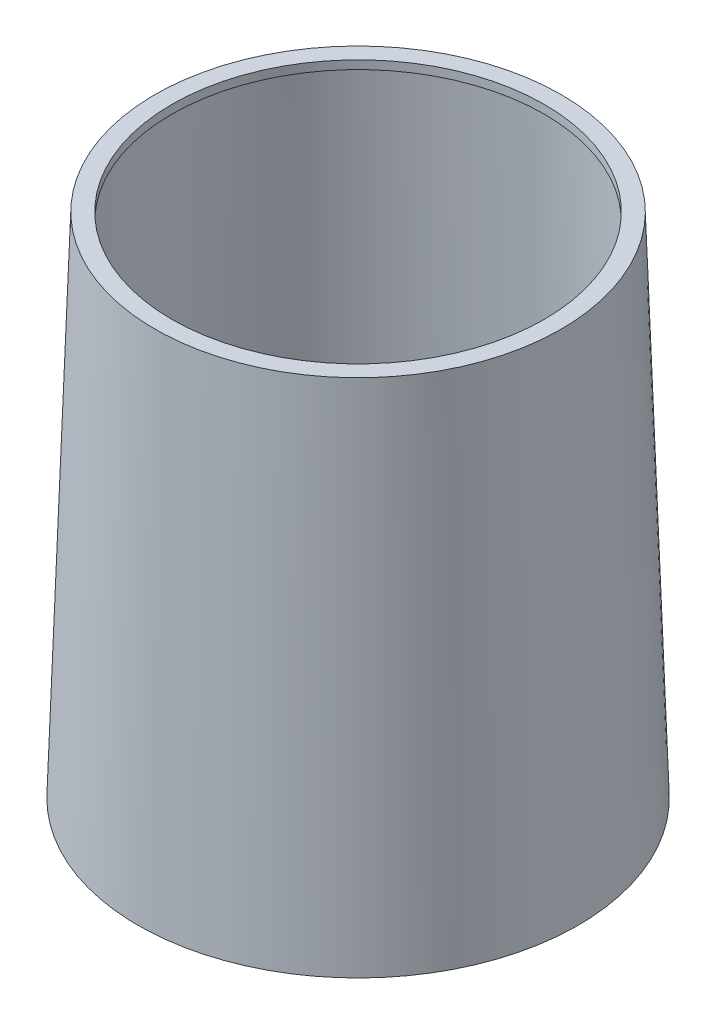
ISO-10303-21;
HEADER;
FILE_DESCRIPTION(('STEP AP214'),'2;1');
FILE_NAME('part.step','',(''),(''),'','','');
FILE_SCHEMA(('AUTOMOTIVE_DESIGN { 1 0 10303 214 1 1 1 1 }'));
ENDSEC;
DATA;
#1=APPLICATION_CONTEXT('core data for automotive mechanical design processes');
#2=APPLICATION_PROTOCOL_DEFINITION('international standard','automotive_design',2000,#1);
#3=PRODUCT_CONTEXT('',#1,'mechanical');
#4=PRODUCT('Part','Part','',(#3));
#5=PRODUCT_RELATED_PRODUCT_CATEGORY('part','',(#4));
#6=PRODUCT_DEFINITION_FORMATION('','',#4);
#7=PRODUCT_DEFINITION_CONTEXT('part definition',#1,'design');
#8=PRODUCT_DEFINITION('design','',#6,#7);
#9=PRODUCT_DEFINITION_SHAPE('','',#8);
#10=(LENGTH_UNIT() NAMED_UNIT(*) SI_UNIT(.MILLI.,.METRE.));
#11=(NAMED_UNIT(*) PLANE_ANGLE_UNIT() SI_UNIT($,.RADIAN.));
#12=(NAMED_UNIT(*) SI_UNIT($,.STERADIAN.) SOLID_ANGLE_UNIT());
#13=UNCERTAINTY_MEASURE_WITH_UNIT(LENGTH_MEASURE(1.E-05),#10,'distance_accuracy_value','');
#14=(GEOMETRIC_REPRESENTATION_CONTEXT(3) GLOBAL_UNCERTAINTY_ASSIGNED_CONTEXT((#13)) GLOBAL_UNIT_ASSIGNED_CONTEXT((#10,
#11,#12)) REPRESENTATION_CONTEXT('',''));
#15=CARTESIAN_POINT('',(0.,0.,0.));
#16=DIRECTION('',(0.,0.,1.));
#17=DIRECTION('',(1.,0.,0.));
#18=AXIS2_PLACEMENT_3D('',#15,#16,#17);
#19=CARTESIAN_POINT('',(0.,30.,0.));
#20=DIRECTION('',(0.,1.,0.));
#21=DIRECTION('',(0.,0.,1.));
#22=AXIS2_PLACEMENT_3D('',#19,#20,#21);
#23=PLANE('',#22);
#24=CARTESIAN_POINT('',(0.,30.,0.));
#25=DIRECTION('',(0.,1.,0.));
#26=DIRECTION('',(0.,0.,1.));
#27=AXIS2_PLACEMENT_3D('',#24,#25,#26);
#28=CIRCLE('',#27,11.);
#29=CARTESIAN_POINT('',(0.,30.,11.));
#30=VERTEX_POINT('',#29);
#31=EDGE_CURVE('E73',#30,#30,#28,.T.);
#32=ORIENTED_EDGE('',*,*,#31,.F.);
#33=EDGE_LOOP('',(#32));
#34=FACE_BOUND('',#33,.T.);
#35=CARTESIAN_POINT('',(0.,30.,0.));
#36=DIRECTION('',(0.,-1.,0.));
#37=DIRECTION('',(0.,0.,-1.));
#38=AXIS2_PLACEMENT_3D('',#35,#36,#37);
#39=CIRCLE('',#38,12.);
#40=CARTESIAN_POINT('',(0.,30.,-12.));
#41=VERTEX_POINT('',#40);
#42=EDGE_CURVE('E89',#41,#41,#39,.T.);
#43=ORIENTED_EDGE('',*,*,#42,.F.);
#44=EDGE_LOOP('',(#43));
#45=FACE_BOUND('',#44,.T.);
#46=ADVANCED_FACE('F49',(#34,#45),#23,.T.);
#47=CARTESIAN_POINT('',(0.,0.,0.));
#48=DIRECTION('',(0.,-1.,0.));
#49=DIRECTION('',(0.,0.,-1.));
#50=AXIS2_PLACEMENT_3D('',#47,#48,#49);
#51=CONICAL_SURFACE('',#50,13.,0.0333209958782472);
#52=ORIENTED_EDGE('',*,*,#42,.T.);
#53=EDGE_LOOP('',(#52));
#54=FACE_BOUND('',#53,.T.);
#55=CARTESIAN_POINT('',(0.,0.,0.));
#56=DIRECTION('',(0.,-1.,0.));
#57=DIRECTION('',(0.,0.,-1.));
#58=AXIS2_PLACEMENT_3D('',#55,#56,#57);
#59=CIRCLE('',#58,13.);
#60=CARTESIAN_POINT('',(0.,0.,-13.));
#61=VERTEX_POINT('',#60);
#62=EDGE_CURVE('E83',#61,#61,#59,.T.);
#63=ORIENTED_EDGE('',*,*,#62,.F.);
#64=EDGE_LOOP('',(#63));
#65=FACE_BOUND('',#64,.T.);
#66=ADVANCED_FACE('F94',(#54,#65),#51,.T.);
#67=CARTESIAN_POINT('',(0.,0.,0.));
#68=DIRECTION('',(0.,-1.,0.));
#69=DIRECTION('',(0.,0.,-1.));
#70=AXIS2_PLACEMENT_3D('',#67,#68,#69);
#71=PLANE('',#70);
#72=CARTESIAN_POINT('',(0.,0.,0.));
#73=DIRECTION('',(0.,-1.,0.));
#74=DIRECTION('',(0.,0.,-1.));
#75=AXIS2_PLACEMENT_3D('',#72,#73,#74);
#76=CIRCLE('',#75,12.5);
#77=CARTESIAN_POINT('',(0.,0.,-12.5));
#78=VERTEX_POINT('',#77);
#79=EDGE_CURVE('E63',#78,#78,#76,.T.);
#80=ORIENTED_EDGE('',*,*,#79,.F.);
#81=EDGE_LOOP('',(#80));
#82=FACE_BOUND('',#81,.T.);
#83=ORIENTED_EDGE('',*,*,#62,.T.);
#84=EDGE_LOOP('',(#83));
#85=FACE_BOUND('',#84,.T.);
#86=ADVANCED_FACE('F103',(#82,#85),#71,.T.);
#87=CARTESIAN_POINT('',(0.,0.,0.));
#88=DIRECTION('',(0.,1.,0.));
#89=DIRECTION('',(0.,0.,1.));
#90=AXIS2_PLACEMENT_3D('',#87,#88,#89);
#91=CYLINDRICAL_SURFACE('',#90,11.);
#92=CARTESIAN_POINT('',(0.,29.5,0.));
#93=DIRECTION('',(0.,1.,0.));
#94=DIRECTION('',(0.,0.,1.));
#95=AXIS2_PLACEMENT_3D('',#92,#93,#94);
#96=CIRCLE('',#95,11.);
#97=CARTESIAN_POINT('',(0.,29.5,11.));
#98=VERTEX_POINT('',#97);
#99=EDGE_CURVE('E78',#98,#98,#96,.F.);
#100=ORIENTED_EDGE('',*,*,#99,.T.);
#101=EDGE_LOOP('',(#100));
#102=FACE_BOUND('',#101,.T.);
#103=ORIENTED_EDGE('',*,*,#31,.T.);
#104=EDGE_LOOP('',(#103));
#105=FACE_BOUND('',#104,.T.);
#106=ADVANCED_FACE('F51',(#102,#105),#91,.F.);
#107=CARTESIAN_POINT('',(11.5163889660065,29.5,0.));
#108=DIRECTION('',(0.,1.,0.));
#109=DIRECTION('',(0.,0.,1.));
#110=AXIS2_PLACEMENT_3D('',#107,#108,#109);
#111=PLANE('',#110);
#112=CARTESIAN_POINT('',(0.,29.5,0.));
#113=DIRECTION('',(0.,-1.,0.));
#114=DIRECTION('',(0.,0.,-1.));
#115=AXIS2_PLACEMENT_3D('',#112,#113,#114);
#116=CIRCLE('',#115,11.5163889660065);
#117=CARTESIAN_POINT('',(0.,29.5,-11.5163889660065));
#118=VERTEX_POINT('',#117);
#119=EDGE_CURVE('E65',#118,#118,#116,.T.);
#120=ORIENTED_EDGE('',*,*,#119,.T.);
#121=EDGE_LOOP('',(#120));
#122=FACE_BOUND('',#121,.T.);
#123=ORIENTED_EDGE('',*,*,#99,.F.);
#124=EDGE_LOOP('',(#123));
#125=FACE_BOUND('',#124,.T.);
#126=ADVANCED_FACE('F106',(#122,#125),#111,.F.);
#127=CARTESIAN_POINT('',(0.,0.5,0.));
#128=DIRECTION('',(0.,-1.,0.));
#129=DIRECTION('',(0.,0.,-1.));
#130=AXIS2_PLACEMENT_3D('',#127,#128,#129);
#131=CONICAL_SURFACE('',#130,12.4830556326732,0.0333209958782472);
#132=ORIENTED_EDGE('',*,*,#119,.F.);
#133=EDGE_LOOP('',(#132));
#134=FACE_BOUND('',#133,.T.);
#135=CARTESIAN_POINT('',(0.,0.5,0.));
#136=DIRECTION('',(0.,-1.,0.));
#137=DIRECTION('',(0.,0.,-1.));
#138=AXIS2_PLACEMENT_3D('',#135,#136,#137);
#139=CIRCLE('',#138,12.4830556326732);
#140=CARTESIAN_POINT('',(0.,0.5,-12.4830556326732));
#141=VERTEX_POINT('',#140);
#142=EDGE_CURVE('E11',#141,#141,#139,.F.);
#143=ORIENTED_EDGE('',*,*,#142,.F.);
#144=EDGE_LOOP('',(#143));
#145=FACE_BOUND('',#144,.T.);
#146=ADVANCED_FACE('F109',(#134,#145),#131,.F.);
#147=CARTESIAN_POINT('',(0.,0.5,0.));
#148=DIRECTION('',(0.,-1.,0.));
#149=DIRECTION('',(0.,0.,-1.));
#150=AXIS2_PLACEMENT_3D('',#147,#148,#149);
#151=CYLINDRICAL_SURFACE('',#150,12.5);
#152=CARTESIAN_POINT('',(0.,0.5,0.));
#153=DIRECTION('',(0.,-1.,0.));
#154=DIRECTION('',(0.,0.,-1.));
#155=AXIS2_PLACEMENT_3D('',#152,#153,#154);
#156=CIRCLE('',#155,12.5);
#157=CARTESIAN_POINT('',(0.,0.5,-12.5));
#158=VERTEX_POINT('',#157);
#159=EDGE_CURVE('E53',#158,#158,#156,.T.);
#160=ORIENTED_EDGE('',*,*,#159,.F.);
#161=EDGE_LOOP('',(#160));
#162=FACE_BOUND('',#161,.T.);
#163=ORIENTED_EDGE('',*,*,#79,.T.);
#164=EDGE_LOOP('',(#163));
#165=FACE_BOUND('',#164,.T.);
#166=ADVANCED_FACE('F112',(#162,#165),#151,.F.);
#167=CARTESIAN_POINT('',(0.,0.5,0.));
#168=DIRECTION('',(0.,-1.,0.));
#169=DIRECTION('',(0.,0.,-1.));
#170=AXIS2_PLACEMENT_3D('',#167,#168,#169);
#171=PLANE('',#170);
#172=ORIENTED_EDGE('',*,*,#159,.T.);
#173=EDGE_LOOP('',(#172));
#174=FACE_BOUND('',#173,.T.);
#175=ORIENTED_EDGE('',*,*,#142,.T.);
#176=EDGE_LOOP('',(#175));
#177=FACE_BOUND('',#176,.T.);
#178=ADVANCED_FACE('F116',(#174,#177),#171,.T.);
#179=CLOSED_SHELL('',(#46,#66,#86,#106,#126,#146,#166,#178));
#180=MANIFOLD_SOLID_BREP('B2',#179);
#181=CARTESIAN_POINT('',(0.,0.,0.));
#182=DIRECTION('',(0.,-1.,0.));
#183=DIRECTION('',(0.,0.,-1.));
#184=AXIS2_PLACEMENT_3D('',#181,#182,#183);
#185=PLANE('',#184);
#186=CARTESIAN_POINT('',(0.,0.,0.));
#187=DIRECTION('',(0.,1.,0.));
#188=DIRECTION('',(0.,0.,1.));
#189=AXIS2_PLACEMENT_3D('',#186,#187,#188);
#190=CIRCLE('',#189,11.);
#191=CARTESIAN_POINT('',(0.,0.,11.));
#192=VERTEX_POINT('',#191);
#193=EDGE_CURVE('E48',#192,#192,#190,.T.);
#194=ORIENTED_EDGE('',*,*,#193,.T.);
#195=EDGE_LOOP('',(#194));
#196=FACE_BOUND('',#195,.T.);
#197=CARTESIAN_POINT('',(0.,0.,0.));
#198=DIRECTION('',(0.,-1.,0.));
#199=DIRECTION('',(0.,0.,-1.));
#200=AXIS2_PLACEMENT_3D('',#197,#198,#199);
#201=CIRCLE('',#200,11.5);
#202=CARTESIAN_POINT('',(0.,0.,-11.5));
#203=VERTEX_POINT('',#202);
#204=EDGE_CURVE('E207',#203,#203,#201,.T.);
#205=ORIENTED_EDGE('',*,*,#204,.T.);
#206=EDGE_LOOP('',(#205));
#207=FACE_BOUND('',#206,.T.);
#208=ADVANCED_FACE('F195',(#196,#207),#185,.T.);
#209=CARTESIAN_POINT('',(0.,0.,0.));
#210=DIRECTION('',(0.,1.,0.));
#211=DIRECTION('',(0.,0.,1.));
#212=AXIS2_PLACEMENT_3D('',#209,#210,#211);
#213=CYLINDRICAL_SURFACE('',#212,11.);
#214=CARTESIAN_POINT('',(0.,0.5,0.));
#215=DIRECTION('',(0.,-1.,0.));
#216=DIRECTION('',(0.,0.,-1.));
#217=AXIS2_PLACEMENT_3D('',#214,#215,#216);
#218=CIRCLE('',#217,11.);
#219=CARTESIAN_POINT('',(0.,0.5,-11.));
#220=VERTEX_POINT('',#219);
#221=EDGE_CURVE('E198',#220,#220,#218,.F.);
#222=ORIENTED_EDGE('',*,*,#221,.T.);
#223=EDGE_LOOP('',(#222));
#224=FACE_BOUND('',#223,.T.);
#225=ORIENTED_EDGE('',*,*,#193,.F.);
#226=EDGE_LOOP('',(#225));
#227=FACE_BOUND('',#226,.T.);
#228=ADVANCED_FACE('F218',(#224,#227),#213,.F.);
#229=CARTESIAN_POINT('',(9.627507591766,0.5,0.));
#230=DIRECTION('',(0.,-1.,0.));
#231=DIRECTION('',(0.,0.,-1.));
#232=AXIS2_PLACEMENT_3D('',#229,#230,#231);
#233=PLANE('',#232);
#234=ORIENTED_EDGE('',*,*,#221,.F.);
#235=EDGE_LOOP('',(#234));
#236=FACE_BOUND('',#235,.T.);
#237=CARTESIAN_POINT('',(0.,0.5,0.));
#238=DIRECTION('',(0.,-1.,0.));
#239=DIRECTION('',(0.,0.,-1.));
#240=AXIS2_PLACEMENT_3D('',#237,#238,#239);
#241=CIRCLE('',#240,11.5);
#242=CARTESIAN_POINT('',(0.,0.5,-11.5));
#243=VERTEX_POINT('',#242);
#244=EDGE_CURVE('E205',#243,#243,#241,.T.);
#245=ORIENTED_EDGE('',*,*,#244,.F.);
#246=EDGE_LOOP('',(#245));
#247=FACE_BOUND('',#246,.T.);
#248=ADVANCED_FACE('F216',(#236,#247),#233,.F.);
#249=CARTESIAN_POINT('',(0.,0.5,0.));
#250=DIRECTION('',(0.,-1.,0.));
#251=DIRECTION('',(0.,0.,-1.));
#252=AXIS2_PLACEMENT_3D('',#249,#250,#251);
#253=CYLINDRICAL_SURFACE('',#252,11.5);
#254=ORIENTED_EDGE('',*,*,#244,.T.);
#255=EDGE_LOOP('',(#254));
#256=FACE_BOUND('',#255,.T.);
#257=ORIENTED_EDGE('',*,*,#204,.F.);
#258=EDGE_LOOP('',(#257));
#259=FACE_BOUND('',#258,.T.);
#260=ADVANCED_FACE('F213',(#256,#259),#253,.T.);
#261=CLOSED_SHELL('',(#208,#228,#248,#260));
#262=MANIFOLD_SOLID_BREP('B6',#261);
#263=ADVANCED_BREP_SHAPE_REPRESENTATION('',(#18,#180,#262),#14);
#264=SHAPE_DEFINITION_REPRESENTATION(#9,#263);
ENDSEC;
END-ISO-10303-21;
